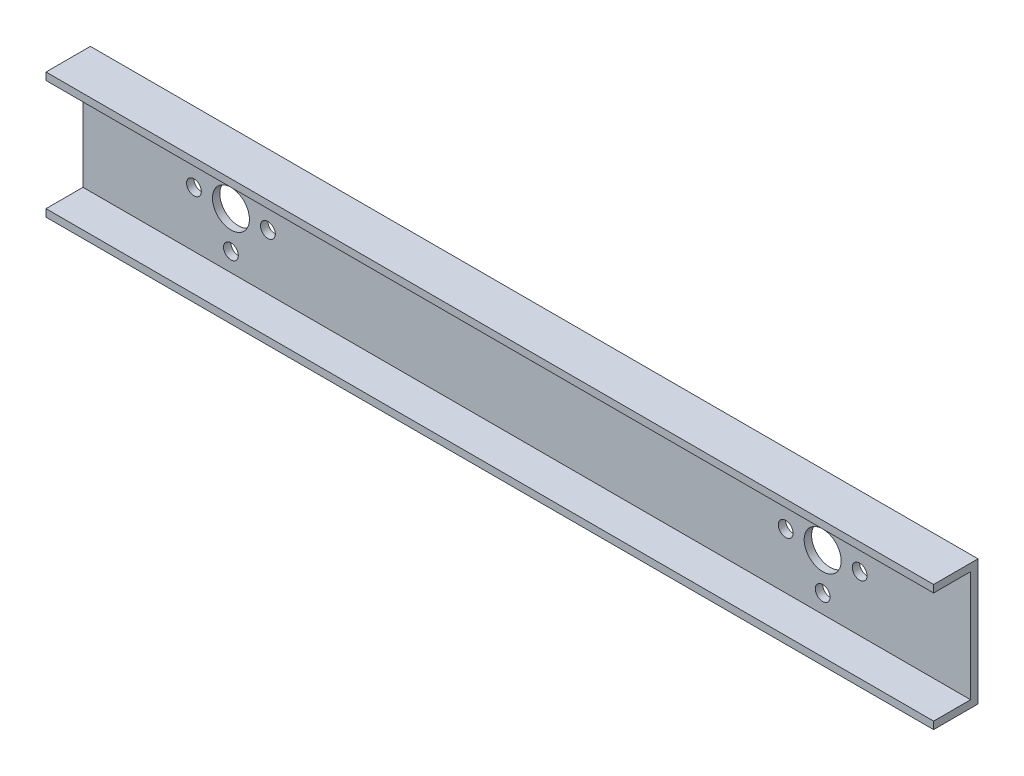
ISO-10303-21;
HEADER;
FILE_DESCRIPTION(('STEP AP214'),'2;1');
FILE_NAME('part.step','',(''),(''),'','','');
FILE_SCHEMA(('AUTOMOTIVE_DESIGN { 1 0 10303 214 1 1 1 1 }'));
ENDSEC;
DATA;
#1=APPLICATION_CONTEXT('core data for automotive mechanical design processes');
#2=APPLICATION_PROTOCOL_DEFINITION('international standard','automotive_design',2000,#1);
#3=PRODUCT_CONTEXT('',#1,'mechanical');
#4=PRODUCT('Part','Part','',(#3));
#5=PRODUCT_RELATED_PRODUCT_CATEGORY('part','',(#4));
#6=PRODUCT_DEFINITION_FORMATION('','',#4);
#7=PRODUCT_DEFINITION_CONTEXT('part definition',#1,'design');
#8=PRODUCT_DEFINITION('design','',#6,#7);
#9=PRODUCT_DEFINITION_SHAPE('','',#8);
#10=(LENGTH_UNIT() NAMED_UNIT(*) SI_UNIT(.MILLI.,.METRE.));
#11=(NAMED_UNIT(*) PLANE_ANGLE_UNIT() SI_UNIT($,.RADIAN.));
#12=(NAMED_UNIT(*) SI_UNIT($,.STERADIAN.) SOLID_ANGLE_UNIT());
#13=UNCERTAINTY_MEASURE_WITH_UNIT(LENGTH_MEASURE(1.E-05),#10,'distance_accuracy_value','');
#14=(GEOMETRIC_REPRESENTATION_CONTEXT(3) GLOBAL_UNCERTAINTY_ASSIGNED_CONTEXT((#13)) GLOBAL_UNIT_ASSIGNED_CONTEXT((#10,
#11,#12)) REPRESENTATION_CONTEXT('',''));
#15=CARTESIAN_POINT('',(0.,0.,0.));
#16=DIRECTION('',(0.,0.,1.));
#17=DIRECTION('',(1.,0.,0.));
#18=AXIS2_PLACEMENT_3D('',#15,#16,#17);
#19=CARTESIAN_POINT('',(1200.,75.,-25.));
#20=DIRECTION('',(0.,0.,-1.));
#21=DIRECTION('',(-1.,0.,0.));
#22=AXIS2_PLACEMENT_3D('',#19,#20,#21);
#23=PLANE('',#22);
#24=CARTESIAN_POINT('',(250.,0.,-25.));
#25=DIRECTION('',(0.,0.,-1.));
#26=DIRECTION('',(-1.,0.,0.));
#27=AXIS2_PLACEMENT_3D('',#24,#25,#26);
#28=CIRCLE('',#27,9.99999999999998);
#29=CARTESIAN_POINT('',(240.,0.,-25.));
#30=VERTEX_POINT('',#29);
#31=EDGE_CURVE('E252',#30,#30,#28,.T.);
#32=ORIENTED_EDGE('',*,*,#31,.T.);
#33=EDGE_LOOP('',(#32));
#34=FACE_BOUND('',#33,.T.);
#35=CARTESIAN_POINT('',(200.,50.,-25.));
#36=DIRECTION('',(0.,0.,-1.));
#37=DIRECTION('',(-1.,0.,0.));
#38=AXIS2_PLACEMENT_3D('',#35,#36,#37);
#39=CIRCLE('',#38,10.0000000000001);
#40=CARTESIAN_POINT('',(190.,50.,-25.));
#41=VERTEX_POINT('',#40);
#42=EDGE_CURVE('E256',#41,#41,#39,.T.);
#43=ORIENTED_EDGE('',*,*,#42,.T.);
#44=EDGE_LOOP('',(#43));
#45=FACE_BOUND('',#44,.T.);
#46=CARTESIAN_POINT('',(200.,-50.,-25.));
#47=DIRECTION('',(0.,0.,-1.));
#48=DIRECTION('',(-1.,0.,0.));
#49=AXIS2_PLACEMENT_3D('',#46,#47,#48);
#50=CIRCLE('',#49,10.0000000000001);
#51=CARTESIAN_POINT('',(190.,-50.,-25.));
#52=VERTEX_POINT('',#51);
#53=EDGE_CURVE('E260',#52,#52,#50,.T.);
#54=ORIENTED_EDGE('',*,*,#53,.T.);
#55=EDGE_LOOP('',(#54));
#56=FACE_BOUND('',#55,.T.);
#57=CARTESIAN_POINT('',(150.,0.,-25.));
#58=DIRECTION('',(0.,0.,-1.));
#59=DIRECTION('',(-1.,0.,0.));
#60=AXIS2_PLACEMENT_3D('',#57,#58,#59);
#61=CIRCLE('',#60,10.0000000000001);
#62=CARTESIAN_POINT('',(140.,0.,-25.));
#63=VERTEX_POINT('',#62);
#64=EDGE_CURVE('E264',#63,#63,#61,.T.);
#65=ORIENTED_EDGE('',*,*,#64,.T.);
#66=EDGE_LOOP('',(#65));
#67=FACE_BOUND('',#66,.T.);
#68=CARTESIAN_POINT('',(200.,0.,-25.));
#69=DIRECTION('',(0.,0.,-1.));
#70=DIRECTION('',(-1.,0.,0.));
#71=AXIS2_PLACEMENT_3D('',#68,#69,#70);
#72=CIRCLE('',#71,25.);
#73=CARTESIAN_POINT('',(175.,0.,-25.));
#74=VERTEX_POINT('',#73);
#75=EDGE_CURVE('E180',#74,#74,#72,.T.);
#76=ORIENTED_EDGE('',*,*,#75,.T.);
#77=EDGE_LOOP('',(#76));
#78=FACE_BOUND('',#77,.T.);
#79=CARTESIAN_POINT('',(950.,0.,-25.));
#80=DIRECTION('',(0.,0.,1.));
#81=DIRECTION('',(1.,0.,0.));
#82=AXIS2_PLACEMENT_3D('',#79,#80,#81);
#83=CIRCLE('',#82,9.99999999999998);
#84=CARTESIAN_POINT('',(960.,0.,-25.));
#85=VERTEX_POINT('',#84);
#86=EDGE_CURVE('E203',#85,#85,#83,.T.);
#87=ORIENTED_EDGE('',*,*,#86,.F.);
#88=EDGE_LOOP('',(#87));
#89=FACE_BOUND('',#88,.T.);
#90=CARTESIAN_POINT('',(1000.,50.,-25.));
#91=DIRECTION('',(0.,0.,1.));
#92=DIRECTION('',(1.,0.,0.));
#93=AXIS2_PLACEMENT_3D('',#90,#91,#92);
#94=CIRCLE('',#93,10.0000000000001);
#95=CARTESIAN_POINT('',(1010.,50.,-25.));
#96=VERTEX_POINT('',#95);
#97=EDGE_CURVE('E199',#96,#96,#94,.T.);
#98=ORIENTED_EDGE('',*,*,#97,.F.);
#99=EDGE_LOOP('',(#98));
#100=FACE_BOUND('',#99,.T.);
#101=CARTESIAN_POINT('',(1000.,-50.,-25.));
#102=DIRECTION('',(0.,0.,1.));
#103=DIRECTION('',(1.,0.,0.));
#104=AXIS2_PLACEMENT_3D('',#101,#102,#103);
#105=CIRCLE('',#104,10.0000000000001);
#106=CARTESIAN_POINT('',(1010.,-50.,-25.));
#107=VERTEX_POINT('',#106);
#108=EDGE_CURVE('E194',#107,#107,#105,.T.);
#109=ORIENTED_EDGE('',*,*,#108,.F.);
#110=EDGE_LOOP('',(#109));
#111=FACE_BOUND('',#110,.T.);
#112=CARTESIAN_POINT('',(1050.,0.,-25.));
#113=DIRECTION('',(0.,0.,1.));
#114=DIRECTION('',(1.,0.,0.));
#115=AXIS2_PLACEMENT_3D('',#112,#113,#114);
#116=CIRCLE('',#115,10.0000000000001);
#117=CARTESIAN_POINT('',(1060.,0.,-25.));
#118=VERTEX_POINT('',#117);
#119=EDGE_CURVE('E190',#118,#118,#116,.T.);
#120=ORIENTED_EDGE('',*,*,#119,.F.);
#121=EDGE_LOOP('',(#120));
#122=FACE_BOUND('',#121,.T.);
#123=CARTESIAN_POINT('',(1000.,0.,-25.));
#124=DIRECTION('',(0.,0.,1.));
#125=DIRECTION('',(1.,0.,0.));
#126=AXIS2_PLACEMENT_3D('',#123,#124,#125);
#127=CIRCLE('',#126,25.);
#128=CARTESIAN_POINT('',(1025.,0.,-25.));
#129=VERTEX_POINT('',#128);
#130=EDGE_CURVE('E165',#129,#129,#127,.T.);
#131=ORIENTED_EDGE('',*,*,#130,.F.);
#132=EDGE_LOOP('',(#131));
#133=FACE_BOUND('',#132,.T.);
#134=DIRECTION('',(0.,-1.,0.));
#135=VECTOR('',#134,1.);
#136=CARTESIAN_POINT('',(0.,75.,-25.));
#137=LINE('',#136,#135);
#138=CARTESIAN_POINT('',(0.,75.,-25.));
#139=VERTEX_POINT('',#138);
#140=CARTESIAN_POINT('',(0.,-75.,-25.));
#141=VERTEX_POINT('',#140);
#142=EDGE_CURVE('E134',#139,#141,#137,.T.);
#143=ORIENTED_EDGE('',*,*,#142,.T.);
#144=DIRECTION('',(-1.,0.,0.));
#145=VECTOR('',#144,1.);
#146=CARTESIAN_POINT('',(1200.,-75.,-25.));
#147=LINE('',#146,#145);
#148=CARTESIAN_POINT('',(1200.,-75.,-25.));
#149=VERTEX_POINT('',#148);
#150=EDGE_CURVE('E11',#149,#141,#147,.T.);
#151=ORIENTED_EDGE('',*,*,#150,.F.);
#152=DIRECTION('',(0.,-1.,0.));
#153=VECTOR('',#152,1.);
#154=CARTESIAN_POINT('',(1200.,75.,-25.));
#155=LINE('',#154,#153);
#156=CARTESIAN_POINT('',(1200.,75.,-25.));
#157=VERTEX_POINT('',#156);
#158=EDGE_CURVE('E149',#157,#149,#155,.T.);
#159=ORIENTED_EDGE('',*,*,#158,.F.);
#160=DIRECTION('',(-1.,0.,0.));
#161=VECTOR('',#160,1.);
#162=CARTESIAN_POINT('',(1200.,75.,-25.));
#163=LINE('',#162,#161);
#164=EDGE_CURVE('E130',#157,#139,#163,.T.);
#165=ORIENTED_EDGE('',*,*,#164,.T.);
#166=EDGE_LOOP('',(#143,#151,#159,#165));
#167=FACE_BOUND('',#166,.T.);
#168=ADVANCED_FACE('F36',(#34,#45,#56,#67,#78,#89,#100,#111,#122,#133,#167),#23,.F.);
#169=CARTESIAN_POINT('',(1200.,-75.,25.));
#170=DIRECTION('',(0.,-1.,0.));
#171=DIRECTION('',(0.,0.,-1.));
#172=AXIS2_PLACEMENT_3D('',#169,#170,#171);
#173=PLANE('',#172);
#174=DIRECTION('',(0.,0.,1.));
#175=VECTOR('',#174,1.);
#176=CARTESIAN_POINT('',(0.,-75.,25.));
#177=LINE('',#176,#175);
#178=CARTESIAN_POINT('',(0.,-75.,25.));
#179=VERTEX_POINT('',#178);
#180=EDGE_CURVE('E137',#141,#179,#177,.T.);
#181=ORIENTED_EDGE('',*,*,#180,.T.);
#182=DIRECTION('',(-1.,0.,0.));
#183=VECTOR('',#182,1.);
#184=CARTESIAN_POINT('',(1200.,-75.,25.));
#185=LINE('',#184,#183);
#186=CARTESIAN_POINT('',(1200.,-75.,25.));
#187=VERTEX_POINT('',#186);
#188=EDGE_CURVE('E45',#187,#179,#185,.T.);
#189=ORIENTED_EDGE('',*,*,#188,.F.);
#190=DIRECTION('',(0.,0.,1.));
#191=VECTOR('',#190,1.);
#192=CARTESIAN_POINT('',(1200.,-75.,25.));
#193=LINE('',#192,#191);
#194=EDGE_CURVE('E97',#149,#187,#193,.T.);
#195=ORIENTED_EDGE('',*,*,#194,.F.);
#196=ORIENTED_EDGE('',*,*,#150,.T.);
#197=EDGE_LOOP('',(#181,#189,#195,#196));
#198=FACE_BOUND('',#197,.T.);
#199=ADVANCED_FACE('F243',(#198),#173,.F.);
#200=CARTESIAN_POINT('',(1200.,-85.,25.));
#201=DIRECTION('',(0.,0.,-1.));
#202=DIRECTION('',(0.,1.,0.));
#203=AXIS2_PLACEMENT_3D('',#200,#201,#202);
#204=PLANE('',#203);
#205=DIRECTION('',(0.,-1.,0.));
#206=VECTOR('',#205,1.);
#207=CARTESIAN_POINT('',(0.,-85.,25.));
#208=LINE('',#207,#206);
#209=CARTESIAN_POINT('',(0.,-85.,25.));
#210=VERTEX_POINT('',#209);
#211=EDGE_CURVE('E140',#179,#210,#208,.T.);
#212=ORIENTED_EDGE('',*,*,#211,.T.);
#213=DIRECTION('',(-1.,0.,0.));
#214=VECTOR('',#213,1.);
#215=CARTESIAN_POINT('',(1200.,-85.,25.));
#216=LINE('',#215,#214);
#217=CARTESIAN_POINT('',(1200.,-85.,25.));
#218=VERTEX_POINT('',#217);
#219=EDGE_CURVE('E156',#218,#210,#216,.T.);
#220=ORIENTED_EDGE('',*,*,#219,.F.);
#221=DIRECTION('',(0.,-1.,0.));
#222=VECTOR('',#221,1.);
#223=CARTESIAN_POINT('',(1200.,-85.,25.));
#224=LINE('',#223,#222);
#225=EDGE_CURVE('E212',#187,#218,#224,.T.);
#226=ORIENTED_EDGE('',*,*,#225,.F.);
#227=ORIENTED_EDGE('',*,*,#188,.T.);
#228=EDGE_LOOP('',(#212,#220,#226,#227));
#229=FACE_BOUND('',#228,.T.);
#230=ADVANCED_FACE('F248',(#229),#204,.F.);
#231=CARTESIAN_POINT('',(1200.,-85.,-35.));
#232=DIRECTION('',(0.,1.,0.));
#233=DIRECTION('',(0.,0.,1.));
#234=AXIS2_PLACEMENT_3D('',#231,#232,#233);
#235=PLANE('',#234);
#236=DIRECTION('',(0.,0.,-1.));
#237=VECTOR('',#236,1.);
#238=CARTESIAN_POINT('',(0.,-85.,-35.));
#239=LINE('',#238,#237);
#240=CARTESIAN_POINT('',(0.,-85.,-35.));
#241=VERTEX_POINT('',#240);
#242=EDGE_CURVE('E142',#210,#241,#239,.T.);
#243=ORIENTED_EDGE('',*,*,#242,.T.);
#244=DIRECTION('',(-1.,0.,0.));
#245=VECTOR('',#244,1.);
#246=CARTESIAN_POINT('',(1200.,-85.,-35.));
#247=LINE('',#246,#245);
#248=CARTESIAN_POINT('',(1200.,-85.,-35.));
#249=VERTEX_POINT('',#248);
#250=EDGE_CURVE('E153',#249,#241,#247,.T.);
#251=ORIENTED_EDGE('',*,*,#250,.F.);
#252=DIRECTION('',(0.,0.,-1.));
#253=VECTOR('',#252,1.);
#254=CARTESIAN_POINT('',(1200.,-85.,-35.));
#255=LINE('',#254,#253);
#256=EDGE_CURVE('E214',#218,#249,#255,.T.);
#257=ORIENTED_EDGE('',*,*,#256,.F.);
#258=ORIENTED_EDGE('',*,*,#219,.T.);
#259=EDGE_LOOP('',(#243,#251,#257,#258));
#260=FACE_BOUND('',#259,.T.);
#261=ADVANCED_FACE('F220',(#260),#235,.F.);
#262=CARTESIAN_POINT('',(1200.,85.,-35.));
#263=DIRECTION('',(0.,0.,1.));
#264=DIRECTION('',(1.,0.,0.));
#265=AXIS2_PLACEMENT_3D('',#262,#263,#264);
#266=PLANE('',#265);
#267=CARTESIAN_POINT('',(250.,0.,-34.9999999999999));
#268=DIRECTION('',(0.,0.,1.));
#269=DIRECTION('',(1.,0.,0.));
#270=AXIS2_PLACEMENT_3D('',#267,#268,#269);
#271=CIRCLE('',#270,9.99999999999998);
#272=CARTESIAN_POINT('',(260.,0.,-34.9999999999999));
#273=VERTEX_POINT('',#272);
#274=EDGE_CURVE('E39',#273,#273,#271,.F.);
#275=ORIENTED_EDGE('',*,*,#274,.F.);
#276=EDGE_LOOP('',(#275));
#277=FACE_BOUND('',#276,.T.);
#278=CARTESIAN_POINT('',(200.,50.,-34.9999999999999));
#279=DIRECTION('',(0.,0.,1.));
#280=DIRECTION('',(1.,0.,0.));
#281=AXIS2_PLACEMENT_3D('',#278,#279,#280);
#282=CIRCLE('',#281,10.0000000000001);
#283=CARTESIAN_POINT('',(210.,50.,-34.9999999999999));
#284=VERTEX_POINT('',#283);
#285=EDGE_CURVE('E185',#284,#284,#282,.F.);
#286=ORIENTED_EDGE('',*,*,#285,.F.);
#287=EDGE_LOOP('',(#286));
#288=FACE_BOUND('',#287,.T.);
#289=CARTESIAN_POINT('',(200.,-50.,-34.9999999999999));
#290=DIRECTION('',(0.,0.,1.));
#291=DIRECTION('',(1.,0.,0.));
#292=AXIS2_PLACEMENT_3D('',#289,#290,#291);
#293=CIRCLE('',#292,10.0000000000001);
#294=CARTESIAN_POINT('',(210.,-50.,-34.9999999999999));
#295=VERTEX_POINT('',#294);
#296=EDGE_CURVE('E183',#295,#295,#293,.F.);
#297=ORIENTED_EDGE('',*,*,#296,.F.);
#298=EDGE_LOOP('',(#297));
#299=FACE_BOUND('',#298,.T.);
#300=CARTESIAN_POINT('',(150.,0.,-34.9999999999999));
#301=DIRECTION('',(0.,0.,1.));
#302=DIRECTION('',(1.,0.,0.));
#303=AXIS2_PLACEMENT_3D('',#300,#301,#302);
#304=CIRCLE('',#303,10.0000000000001);
#305=CARTESIAN_POINT('',(160.,0.,-34.9999999999999));
#306=VERTEX_POINT('',#305);
#307=EDGE_CURVE('E179',#306,#306,#304,.F.);
#308=ORIENTED_EDGE('',*,*,#307,.F.);
#309=EDGE_LOOP('',(#308));
#310=FACE_BOUND('',#309,.T.);
#311=CARTESIAN_POINT('',(200.,0.,-34.9999999999999));
#312=DIRECTION('',(0.,0.,1.));
#313=DIRECTION('',(1.,0.,0.));
#314=AXIS2_PLACEMENT_3D('',#311,#312,#313);
#315=CIRCLE('',#314,25.);
#316=CARTESIAN_POINT('',(225.,0.,-34.9999999999999));
#317=VERTEX_POINT('',#316);
#318=EDGE_CURVE('E176',#317,#317,#315,.F.);
#319=ORIENTED_EDGE('',*,*,#318,.F.);
#320=EDGE_LOOP('',(#319));
#321=FACE_BOUND('',#320,.T.);
#322=CARTESIAN_POINT('',(950.,0.,-34.9999999999999));
#323=DIRECTION('',(0.,0.,1.));
#324=DIRECTION('',(1.,0.,0.));
#325=AXIS2_PLACEMENT_3D('',#322,#323,#324);
#326=CIRCLE('',#325,9.99999999999998);
#327=CARTESIAN_POINT('',(960.,0.,-34.9999999999999));
#328=VERTEX_POINT('',#327);
#329=EDGE_CURVE('E138',#328,#328,#326,.T.);
#330=ORIENTED_EDGE('',*,*,#329,.T.);
#331=EDGE_LOOP('',(#330));
#332=FACE_BOUND('',#331,.T.);
#333=CARTESIAN_POINT('',(1000.,50.,-34.9999999999999));
#334=DIRECTION('',(0.,0.,1.));
#335=DIRECTION('',(1.,0.,0.));
#336=AXIS2_PLACEMENT_3D('',#333,#334,#335);
#337=CIRCLE('',#336,10.0000000000001);
#338=CARTESIAN_POINT('',(1010.,50.,-34.9999999999999));
#339=VERTEX_POINT('',#338);
#340=EDGE_CURVE('E171',#339,#339,#337,.T.);
#341=ORIENTED_EDGE('',*,*,#340,.T.);
#342=EDGE_LOOP('',(#341));
#343=FACE_BOUND('',#342,.T.);
#344=CARTESIAN_POINT('',(1000.,-50.,-34.9999999999999));
#345=DIRECTION('',(0.,0.,1.));
#346=DIRECTION('',(1.,0.,0.));
#347=AXIS2_PLACEMENT_3D('',#344,#345,#346);
#348=CIRCLE('',#347,10.0000000000001);
#349=CARTESIAN_POINT('',(1010.,-50.,-34.9999999999999));
#350=VERTEX_POINT('',#349);
#351=EDGE_CURVE('E168',#350,#350,#348,.T.);
#352=ORIENTED_EDGE('',*,*,#351,.T.);
#353=EDGE_LOOP('',(#352));
#354=FACE_BOUND('',#353,.T.);
#355=CARTESIAN_POINT('',(1050.,0.,-34.9999999999999));
#356=DIRECTION('',(0.,0.,1.));
#357=DIRECTION('',(1.,0.,0.));
#358=AXIS2_PLACEMENT_3D('',#355,#356,#357);
#359=CIRCLE('',#358,10.0000000000001);
#360=CARTESIAN_POINT('',(1060.,0.,-34.9999999999999));
#361=VERTEX_POINT('',#360);
#362=EDGE_CURVE('E164',#361,#361,#359,.T.);
#363=ORIENTED_EDGE('',*,*,#362,.T.);
#364=EDGE_LOOP('',(#363));
#365=FACE_BOUND('',#364,.T.);
#366=CARTESIAN_POINT('',(1000.,0.,-34.9999999999999));
#367=DIRECTION('',(0.,0.,1.));
#368=DIRECTION('',(1.,0.,0.));
#369=AXIS2_PLACEMENT_3D('',#366,#367,#368);
#370=CIRCLE('',#369,25.);
#371=CARTESIAN_POINT('',(1025.,0.,-34.9999999999999));
#372=VERTEX_POINT('',#371);
#373=EDGE_CURVE('E161',#372,#372,#370,.T.);
#374=ORIENTED_EDGE('',*,*,#373,.T.);
#375=EDGE_LOOP('',(#374));
#376=FACE_BOUND('',#375,.T.);
#377=DIRECTION('',(0.,1.,0.));
#378=VECTOR('',#377,1.);
#379=CARTESIAN_POINT('',(0.,85.,-35.));
#380=LINE('',#379,#378);
#381=CARTESIAN_POINT('',(0.,85.,-35.));
#382=VERTEX_POINT('',#381);
#383=EDGE_CURVE('E144',#241,#382,#380,.T.);
#384=ORIENTED_EDGE('',*,*,#383,.T.);
#385=DIRECTION('',(-1.,0.,0.));
#386=VECTOR('',#385,1.);
#387=CARTESIAN_POINT('',(1200.,85.,-35.));
#388=LINE('',#387,#386);
#389=CARTESIAN_POINT('',(1200.,85.,-35.));
#390=VERTEX_POINT('',#389);
#391=EDGE_CURVE('E125',#390,#382,#388,.T.);
#392=ORIENTED_EDGE('',*,*,#391,.F.);
#393=DIRECTION('',(0.,1.,0.));
#394=VECTOR('',#393,1.);
#395=CARTESIAN_POINT('',(1200.,85.,-35.));
#396=LINE('',#395,#394);
#397=EDGE_CURVE('E116',#249,#390,#396,.T.);
#398=ORIENTED_EDGE('',*,*,#397,.F.);
#399=ORIENTED_EDGE('',*,*,#250,.T.);
#400=EDGE_LOOP('',(#384,#392,#398,#399));
#401=FACE_BOUND('',#400,.T.);
#402=ADVANCED_FACE('F224',(#277,#288,#299,#310,#321,#332,#343,#354,#365,#376,#401),#266,.F.);
#403=CARTESIAN_POINT('',(1200.,85.,25.));
#404=DIRECTION('',(0.,-1.,0.));
#405=DIRECTION('',(0.,0.,-1.));
#406=AXIS2_PLACEMENT_3D('',#403,#404,#405);
#407=PLANE('',#406);
#408=DIRECTION('',(0.,0.,1.));
#409=VECTOR('',#408,1.);
#410=CARTESIAN_POINT('',(0.,85.,25.));
#411=LINE('',#410,#409);
#412=CARTESIAN_POINT('',(0.,85.,25.));
#413=VERTEX_POINT('',#412);
#414=EDGE_CURVE('E124',#382,#413,#411,.T.);
#415=ORIENTED_EDGE('',*,*,#414,.T.);
#416=DIRECTION('',(-1.,0.,0.));
#417=VECTOR('',#416,1.);
#418=CARTESIAN_POINT('',(1200.,85.,25.));
#419=LINE('',#418,#417);
#420=CARTESIAN_POINT('',(1200.,85.,25.));
#421=VERTEX_POINT('',#420);
#422=EDGE_CURVE('E121',#421,#413,#419,.T.);
#423=ORIENTED_EDGE('',*,*,#422,.F.);
#424=DIRECTION('',(0.,0.,1.));
#425=VECTOR('',#424,1.);
#426=CARTESIAN_POINT('',(1200.,85.,25.));
#427=LINE('',#426,#425);
#428=EDGE_CURVE('E110',#390,#421,#427,.T.);
#429=ORIENTED_EDGE('',*,*,#428,.F.);
#430=ORIENTED_EDGE('',*,*,#391,.T.);
#431=EDGE_LOOP('',(#415,#423,#429,#430));
#432=FACE_BOUND('',#431,.T.);
#433=ADVANCED_FACE('F122',(#432),#407,.F.);
#434=CARTESIAN_POINT('',(1200.,75.,25.));
#435=DIRECTION('',(0.,0.,-1.));
#436=DIRECTION('',(0.,1.,0.));
#437=AXIS2_PLACEMENT_3D('',#434,#435,#436);
#438=PLANE('',#437);
#439=DIRECTION('',(0.,-1.,0.));
#440=VECTOR('',#439,1.);
#441=CARTESIAN_POINT('',(0.,75.,25.));
#442=LINE('',#441,#440);
#443=CARTESIAN_POINT('',(0.,75.,25.));
#444=VERTEX_POINT('',#443);
#445=EDGE_CURVE('E83',#413,#444,#442,.T.);
#446=ORIENTED_EDGE('',*,*,#445,.T.);
#447=DIRECTION('',(-1.,0.,0.));
#448=VECTOR('',#447,1.);
#449=CARTESIAN_POINT('',(1200.,75.,25.));
#450=LINE('',#449,#448);
#451=CARTESIAN_POINT('',(1200.,75.,25.));
#452=VERTEX_POINT('',#451);
#453=EDGE_CURVE('E126',#452,#444,#450,.T.);
#454=ORIENTED_EDGE('',*,*,#453,.F.);
#455=DIRECTION('',(0.,-1.,0.));
#456=VECTOR('',#455,1.);
#457=CARTESIAN_POINT('',(1200.,75.,25.));
#458=LINE('',#457,#456);
#459=EDGE_CURVE('E114',#421,#452,#458,.T.);
#460=ORIENTED_EDGE('',*,*,#459,.F.);
#461=ORIENTED_EDGE('',*,*,#422,.T.);
#462=EDGE_LOOP('',(#446,#454,#460,#461));
#463=FACE_BOUND('',#462,.T.);
#464=ADVANCED_FACE('F128',(#463),#438,.F.);
#465=CARTESIAN_POINT('',(1200.,75.,25.));
#466=DIRECTION('',(0.,1.,0.));
#467=DIRECTION('',(0.,0.,1.));
#468=AXIS2_PLACEMENT_3D('',#465,#466,#467);
#469=PLANE('',#468);
#470=DIRECTION('',(0.,0.,-1.));
#471=VECTOR('',#470,1.);
#472=CARTESIAN_POINT('',(0.,75.,25.));
#473=LINE('',#472,#471);
#474=EDGE_CURVE('E89',#444,#139,#473,.T.);
#475=ORIENTED_EDGE('',*,*,#474,.T.);
#476=ORIENTED_EDGE('',*,*,#164,.F.);
#477=DIRECTION('',(0.,0.,-1.));
#478=VECTOR('',#477,1.);
#479=CARTESIAN_POINT('',(1200.,75.,25.));
#480=LINE('',#479,#478);
#481=EDGE_CURVE('E54',#452,#157,#480,.T.);
#482=ORIENTED_EDGE('',*,*,#481,.F.);
#483=ORIENTED_EDGE('',*,*,#453,.T.);
#484=EDGE_LOOP('',(#475,#476,#482,#483));
#485=FACE_BOUND('',#484,.T.);
#486=ADVANCED_FACE('F232',(#485),#469,.F.);
#487=CARTESIAN_POINT('',(1200.,0.,0.));
#488=DIRECTION('',(1.,0.,0.));
#489=DIRECTION('',(0.,0.,-1.));
#490=AXIS2_PLACEMENT_3D('',#487,#488,#489);
#491=PLANE('',#490);
#492=ORIENTED_EDGE('',*,*,#158,.T.);
#493=ORIENTED_EDGE('',*,*,#194,.T.);
#494=ORIENTED_EDGE('',*,*,#225,.T.);
#495=ORIENTED_EDGE('',*,*,#256,.T.);
#496=ORIENTED_EDGE('',*,*,#397,.T.);
#497=ORIENTED_EDGE('',*,*,#428,.T.);
#498=ORIENTED_EDGE('',*,*,#459,.T.);
#499=ORIENTED_EDGE('',*,*,#481,.T.);
#500=EDGE_LOOP('',(#492,#493,#494,#495,#496,#497,#498,#499));
#501=FACE_BOUND('',#500,.T.);
#502=ADVANCED_FACE('F112',(#501),#491,.T.);
#503=CARTESIAN_POINT('',(0.,0.,0.));
#504=DIRECTION('',(1.,0.,0.));
#505=DIRECTION('',(0.,0.,-1.));
#506=AXIS2_PLACEMENT_3D('',#503,#504,#505);
#507=PLANE('',#506);
#508=ORIENTED_EDGE('',*,*,#142,.F.);
#509=ORIENTED_EDGE('',*,*,#474,.F.);
#510=ORIENTED_EDGE('',*,*,#445,.F.);
#511=ORIENTED_EDGE('',*,*,#414,.F.);
#512=ORIENTED_EDGE('',*,*,#383,.F.);
#513=ORIENTED_EDGE('',*,*,#242,.F.);
#514=ORIENTED_EDGE('',*,*,#211,.F.);
#515=ORIENTED_EDGE('',*,*,#180,.F.);
#516=EDGE_LOOP('',(#508,#509,#510,#511,#512,#513,#514,#515));
#517=FACE_BOUND('',#516,.T.);
#518=ADVANCED_FACE('F227',(#517),#507,.F.);
#519=CARTESIAN_POINT('',(1000.,0.,-1225.));
#520=DIRECTION('',(0.,0.,1.));
#521=DIRECTION('',(1.,0.,0.));
#522=AXIS2_PLACEMENT_3D('',#519,#520,#521);
#523=CYLINDRICAL_SURFACE('',#522,25.);
#524=ORIENTED_EDGE('',*,*,#130,.T.);
#525=EDGE_LOOP('',(#524));
#526=FACE_BOUND('',#525,.T.);
#527=ORIENTED_EDGE('',*,*,#373,.F.);
#528=EDGE_LOOP('',(#527));
#529=FACE_BOUND('',#528,.T.);
#530=ADVANCED_FACE('F277',(#526,#529),#523,.F.);
#531=CARTESIAN_POINT('',(1050.,0.,-1225.));
#532=DIRECTION('',(0.,0.,1.));
#533=DIRECTION('',(1.,0.,0.));
#534=AXIS2_PLACEMENT_3D('',#531,#532,#533);
#535=CYLINDRICAL_SURFACE('',#534,10.0000000000001);
#536=ORIENTED_EDGE('',*,*,#119,.T.);
#537=EDGE_LOOP('',(#536));
#538=FACE_BOUND('',#537,.T.);
#539=ORIENTED_EDGE('',*,*,#362,.F.);
#540=EDGE_LOOP('',(#539));
#541=FACE_BOUND('',#540,.T.);
#542=ADVANCED_FACE('F280',(#538,#541),#535,.F.);
#543=CARTESIAN_POINT('',(1000.,-50.,-1225.));
#544=DIRECTION('',(0.,0.,1.));
#545=DIRECTION('',(1.,0.,0.));
#546=AXIS2_PLACEMENT_3D('',#543,#544,#545);
#547=CYLINDRICAL_SURFACE('',#546,10.0000000000001);
#548=ORIENTED_EDGE('',*,*,#108,.T.);
#549=EDGE_LOOP('',(#548));
#550=FACE_BOUND('',#549,.T.);
#551=ORIENTED_EDGE('',*,*,#351,.F.);
#552=EDGE_LOOP('',(#551));
#553=FACE_BOUND('',#552,.T.);
#554=ADVANCED_FACE('F350',(#550,#553),#547,.F.);
#555=CARTESIAN_POINT('',(1000.,50.,-1225.));
#556=DIRECTION('',(0.,0.,1.));
#557=DIRECTION('',(1.,0.,0.));
#558=AXIS2_PLACEMENT_3D('',#555,#556,#557);
#559=CYLINDRICAL_SURFACE('',#558,10.0000000000001);
#560=ORIENTED_EDGE('',*,*,#97,.T.);
#561=EDGE_LOOP('',(#560));
#562=FACE_BOUND('',#561,.T.);
#563=ORIENTED_EDGE('',*,*,#340,.F.);
#564=EDGE_LOOP('',(#563));
#565=FACE_BOUND('',#564,.T.);
#566=ADVANCED_FACE('F359',(#562,#565),#559,.F.);
#567=CARTESIAN_POINT('',(950.,0.,-1225.));
#568=DIRECTION('',(0.,0.,1.));
#569=DIRECTION('',(1.,0.,0.));
#570=AXIS2_PLACEMENT_3D('',#567,#568,#569);
#571=CYLINDRICAL_SURFACE('',#570,9.99999999999998);
#572=ORIENTED_EDGE('',*,*,#86,.T.);
#573=EDGE_LOOP('',(#572));
#574=FACE_BOUND('',#573,.T.);
#575=ORIENTED_EDGE('',*,*,#329,.F.);
#576=EDGE_LOOP('',(#575));
#577=FACE_BOUND('',#576,.T.);
#578=ADVANCED_FACE('F369',(#574,#577),#571,.F.);
#579=CARTESIAN_POINT('',(200.,0.,-1225.));
#580=DIRECTION('',(0.,0.,1.));
#581=DIRECTION('',(1.,0.,0.));
#582=AXIS2_PLACEMENT_3D('',#579,#580,#581);
#583=CYLINDRICAL_SURFACE('',#582,25.);
#584=ORIENTED_EDGE('',*,*,#75,.F.);
#585=EDGE_LOOP('',(#584));
#586=FACE_BOUND('',#585,.T.);
#587=ORIENTED_EDGE('',*,*,#318,.T.);
#588=EDGE_LOOP('',(#587));
#589=FACE_BOUND('',#588,.T.);
#590=ADVANCED_FACE('F378',(#586,#589),#583,.F.);
#591=CARTESIAN_POINT('',(150.,0.,-1225.));
#592=DIRECTION('',(0.,0.,1.));
#593=DIRECTION('',(1.,0.,0.));
#594=AXIS2_PLACEMENT_3D('',#591,#592,#593);
#595=CYLINDRICAL_SURFACE('',#594,10.0000000000001);
#596=ORIENTED_EDGE('',*,*,#64,.F.);
#597=EDGE_LOOP('',(#596));
#598=FACE_BOUND('',#597,.T.);
#599=ORIENTED_EDGE('',*,*,#307,.T.);
#600=EDGE_LOOP('',(#599));
#601=FACE_BOUND('',#600,.T.);
#602=ADVANCED_FACE('F397',(#598,#601),#595,.F.);
#603=CARTESIAN_POINT('',(200.,-50.,-1225.));
#604=DIRECTION('',(0.,0.,1.));
#605=DIRECTION('',(1.,0.,0.));
#606=AXIS2_PLACEMENT_3D('',#603,#604,#605);
#607=CYLINDRICAL_SURFACE('',#606,10.0000000000001);
#608=ORIENTED_EDGE('',*,*,#53,.F.);
#609=EDGE_LOOP('',(#608));
#610=FACE_BOUND('',#609,.T.);
#611=ORIENTED_EDGE('',*,*,#296,.T.);
#612=EDGE_LOOP('',(#611));
#613=FACE_BOUND('',#612,.T.);
#614=ADVANCED_FACE('F407',(#610,#613),#607,.F.);
#615=CARTESIAN_POINT('',(200.,50.,-1225.));
#616=DIRECTION('',(0.,0.,1.));
#617=DIRECTION('',(1.,0.,0.));
#618=AXIS2_PLACEMENT_3D('',#615,#616,#617);
#619=CYLINDRICAL_SURFACE('',#618,10.0000000000001);
#620=ORIENTED_EDGE('',*,*,#42,.F.);
#621=EDGE_LOOP('',(#620));
#622=FACE_BOUND('',#621,.T.);
#623=ORIENTED_EDGE('',*,*,#285,.T.);
#624=EDGE_LOOP('',(#623));
#625=FACE_BOUND('',#624,.T.);
#626=ADVANCED_FACE('F417',(#622,#625),#619,.F.);
#627=CARTESIAN_POINT('',(250.,0.,-1225.));
#628=DIRECTION('',(0.,0.,1.));
#629=DIRECTION('',(1.,0.,0.));
#630=AXIS2_PLACEMENT_3D('',#627,#628,#629);
#631=CYLINDRICAL_SURFACE('',#630,9.99999999999998);
#632=ORIENTED_EDGE('',*,*,#31,.F.);
#633=EDGE_LOOP('',(#632));
#634=FACE_BOUND('',#633,.T.);
#635=ORIENTED_EDGE('',*,*,#274,.T.);
#636=EDGE_LOOP('',(#635));
#637=FACE_BOUND('',#636,.T.);
#638=ADVANCED_FACE('F427',(#634,#637),#631,.F.);
#639=CLOSED_SHELL('',(#168,#199,#230,#261,#402,#433,#464,#486,#502,#518,#530,#542,#554,#566,
#578,#590,#602,#614,#626,#638));
#640=MANIFOLD_SOLID_BREP('B2',#639);
#641=ADVANCED_BREP_SHAPE_REPRESENTATION('',(#18,#640),#14);
#642=SHAPE_DEFINITION_REPRESENTATION(#9,#641);
ENDSEC;
END-ISO-10303-21;
